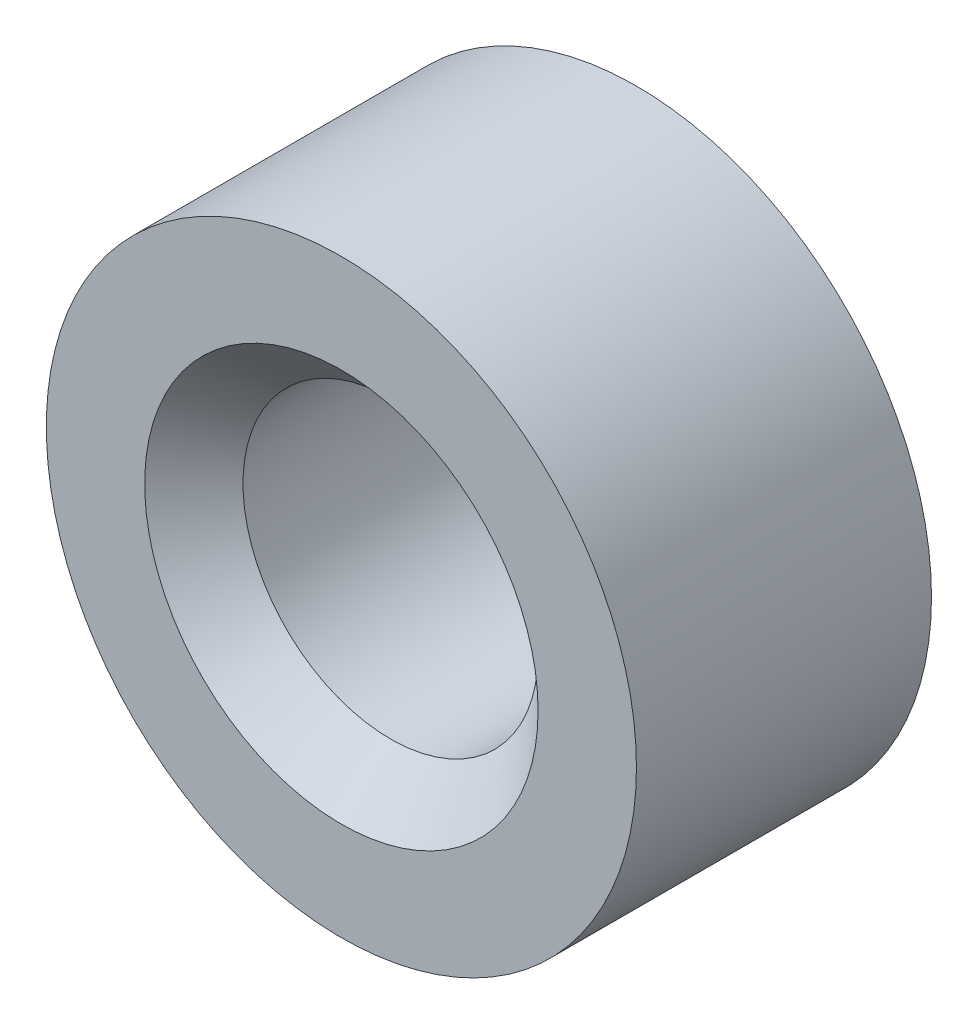
ISO-10303-21;
HEADER;
FILE_DESCRIPTION(('STEP AP214'),'2;1');
FILE_NAME('part.step','',(''),(''),'','','');
FILE_SCHEMA(('AUTOMOTIVE_DESIGN { 1 0 10303 214 1 1 1 1 }'));
ENDSEC;
DATA;
#1=APPLICATION_CONTEXT('core data for automotive mechanical design processes');
#2=APPLICATION_PROTOCOL_DEFINITION('international standard','automotive_design',2000,#1);
#3=PRODUCT_CONTEXT('',#1,'mechanical');
#4=PRODUCT('Part','Part','',(#3));
#5=PRODUCT_RELATED_PRODUCT_CATEGORY('part','',(#4));
#6=PRODUCT_DEFINITION_FORMATION('','',#4);
#7=PRODUCT_DEFINITION_CONTEXT('part definition',#1,'design');
#8=PRODUCT_DEFINITION('design','',#6,#7);
#9=PRODUCT_DEFINITION_SHAPE('','',#8);
#10=(LENGTH_UNIT() NAMED_UNIT(*) SI_UNIT(.MILLI.,.METRE.));
#11=(NAMED_UNIT(*) PLANE_ANGLE_UNIT() SI_UNIT($,.RADIAN.));
#12=(NAMED_UNIT(*) SI_UNIT($,.STERADIAN.) SOLID_ANGLE_UNIT());
#13=UNCERTAINTY_MEASURE_WITH_UNIT(LENGTH_MEASURE(1.E-05),#10,'distance_accuracy_value','');
#14=(GEOMETRIC_REPRESENTATION_CONTEXT(3) GLOBAL_UNCERTAINTY_ASSIGNED_CONTEXT((#13)) GLOBAL_UNIT_ASSIGNED_CONTEXT((#10,
#11,#12)) REPRESENTATION_CONTEXT('',''));
#15=CARTESIAN_POINT('',(0.,0.,0.));
#16=DIRECTION('',(0.,0.,1.));
#17=DIRECTION('',(1.,0.,0.));
#18=AXIS2_PLACEMENT_3D('',#15,#16,#17);
#19=CARTESIAN_POINT('',(0.,0.,3.));
#20=DIRECTION('',(0.,0.,1.));
#21=DIRECTION('',(1.,0.,0.));
#22=AXIS2_PLACEMENT_3D('',#19,#20,#21);
#23=PLANE('',#22);
#24=CARTESIAN_POINT('',(0.,0.,3.));
#25=DIRECTION('',(0.,0.,1.));
#26=DIRECTION('',(1.,0.,0.));
#27=AXIS2_PLACEMENT_3D('',#24,#25,#26);
#28=CIRCLE('',#27,2.);
#29=CARTESIAN_POINT('',(2.,0.,3.));
#30=VERTEX_POINT('',#29);
#31=EDGE_CURVE('E57',#30,#30,#28,.F.);
#32=ORIENTED_EDGE('',*,*,#31,.T.);
#33=EDGE_LOOP('',(#32));
#34=FACE_BOUND('',#33,.T.);
#35=CARTESIAN_POINT('',(0.,0.,3.));
#36=DIRECTION('',(0.,0.,1.));
#37=DIRECTION('',(1.,0.,0.));
#38=AXIS2_PLACEMENT_3D('',#35,#36,#37);
#39=CIRCLE('',#38,3.);
#40=CARTESIAN_POINT('',(3.,0.,3.));
#41=VERTEX_POINT('',#40);
#42=EDGE_CURVE('E68',#41,#41,#39,.T.);
#43=ORIENTED_EDGE('',*,*,#42,.T.);
#44=EDGE_LOOP('',(#43));
#45=FACE_BOUND('',#44,.T.);
#46=ADVANCED_FACE('F43',(#34,#45),#23,.T.);
#47=CARTESIAN_POINT('',(0.,0.,0.));
#48=DIRECTION('',(0.,0.,1.));
#49=DIRECTION('',(1.,0.,0.));
#50=AXIS2_PLACEMENT_3D('',#47,#48,#49);
#51=PLANE('',#50);
#52=CARTESIAN_POINT('',(0.,0.,0.));
#53=DIRECTION('',(0.,0.,1.));
#54=DIRECTION('',(1.,0.,0.));
#55=AXIS2_PLACEMENT_3D('',#52,#53,#54);
#56=CIRCLE('',#55,2.);
#57=CARTESIAN_POINT('',(2.,0.,0.));
#58=VERTEX_POINT('',#57);
#59=EDGE_CURVE('E52',#58,#58,#56,.T.);
#60=ORIENTED_EDGE('',*,*,#59,.T.);
#61=EDGE_LOOP('',(#60));
#62=FACE_BOUND('',#61,.T.);
#63=CARTESIAN_POINT('',(0.,0.,0.));
#64=DIRECTION('',(0.,0.,1.));
#65=DIRECTION('',(1.,0.,0.));
#66=AXIS2_PLACEMENT_3D('',#63,#64,#65);
#67=CIRCLE('',#66,3.);
#68=CARTESIAN_POINT('',(3.,0.,0.));
#69=VERTEX_POINT('',#68);
#70=EDGE_CURVE('E69',#69,#69,#67,.T.);
#71=ORIENTED_EDGE('',*,*,#70,.F.);
#72=EDGE_LOOP('',(#71));
#73=FACE_BOUND('',#72,.T.);
#74=ADVANCED_FACE('F82',(#62,#73),#51,.F.);
#75=CARTESIAN_POINT('',(0.,0.,3.));
#76=DIRECTION('',(0.,0.,-1.));
#77=DIRECTION('',(-1.,0.,0.));
#78=AXIS2_PLACEMENT_3D('',#75,#76,#77);
#79=CYLINDRICAL_SURFACE('',#78,3.);
#80=ORIENTED_EDGE('',*,*,#42,.F.);
#81=EDGE_LOOP('',(#80));
#82=FACE_BOUND('',#81,.T.);
#83=ORIENTED_EDGE('',*,*,#70,.T.);
#84=EDGE_LOOP('',(#83));
#85=FACE_BOUND('',#84,.T.);
#86=ADVANCED_FACE('F78',(#82,#85),#79,.T.);
#87=CARTESIAN_POINT('',(0.,0.,3.));
#88=DIRECTION('',(0.,0.,-1.));
#89=DIRECTION('',(-1.,0.,0.));
#90=AXIS2_PLACEMENT_3D('',#87,#88,#89);
#91=CYLINDRICAL_SURFACE('',#90,1.5);
#92=CARTESIAN_POINT('',(0.,0.,0.500000000000001));
#93=DIRECTION('',(0.,0.,1.));
#94=DIRECTION('',(1.,0.,0.));
#95=AXIS2_PLACEMENT_3D('',#92,#93,#94);
#96=CIRCLE('',#95,1.5);
#97=CARTESIAN_POINT('',(1.5,0.,0.500000000000001));
#98=VERTEX_POINT('',#97);
#99=EDGE_CURVE('E10',#98,#98,#96,.F.);
#100=ORIENTED_EDGE('',*,*,#99,.T.);
#101=EDGE_LOOP('',(#100));
#102=FACE_BOUND('',#101,.T.);
#103=CARTESIAN_POINT('',(0.,0.,2.5));
#104=DIRECTION('',(0.,0.,1.));
#105=DIRECTION('',(1.,0.,0.));
#106=AXIS2_PLACEMENT_3D('',#103,#104,#105);
#107=CIRCLE('',#106,1.5);
#108=CARTESIAN_POINT('',(1.5,0.,2.5));
#109=VERTEX_POINT('',#108);
#110=EDGE_CURVE('E62',#109,#109,#107,.T.);
#111=ORIENTED_EDGE('',*,*,#110,.T.);
#112=EDGE_LOOP('',(#111));
#113=FACE_BOUND('',#112,.T.);
#114=ADVANCED_FACE('F81',(#102,#113),#91,.F.);
#115=CARTESIAN_POINT('',(0.,0.,2.5));
#116=DIRECTION('',(0.,0.,1.));
#117=DIRECTION('',(1.,0.,0.));
#118=AXIS2_PLACEMENT_3D('',#115,#116,#117);
#119=CONICAL_SURFACE('',#118,1.5,0.78539816339745);
#120=ORIENTED_EDGE('',*,*,#31,.F.);
#121=EDGE_LOOP('',(#120));
#122=FACE_BOUND('',#121,.T.);
#123=ORIENTED_EDGE('',*,*,#110,.F.);
#124=EDGE_LOOP('',(#123));
#125=FACE_BOUND('',#124,.T.);
#126=ADVANCED_FACE('F95',(#122,#125),#119,.F.);
#127=CARTESIAN_POINT('',(0.,0.,0.));
#128=DIRECTION('',(0.,0.,-1.));
#129=DIRECTION('',(-1.,0.,0.));
#130=AXIS2_PLACEMENT_3D('',#127,#128,#129);
#131=CONICAL_SURFACE('',#130,2.,0.785398163397446);
#132=ORIENTED_EDGE('',*,*,#99,.F.);
#133=EDGE_LOOP('',(#132));
#134=FACE_BOUND('',#133,.T.);
#135=ORIENTED_EDGE('',*,*,#59,.F.);
#136=EDGE_LOOP('',(#135));
#137=FACE_BOUND('',#136,.T.);
#138=ADVANCED_FACE('F46',(#134,#137),#131,.F.);
#139=CLOSED_SHELL('',(#46,#74,#86,#114,#126,#138));
#140=MANIFOLD_SOLID_BREP('B2',#139);
#141=ADVANCED_BREP_SHAPE_REPRESENTATION('',(#18,#140),#14);
#142=SHAPE_DEFINITION_REPRESENTATION(#9,#141);
ENDSEC;
END-ISO-10303-21;
